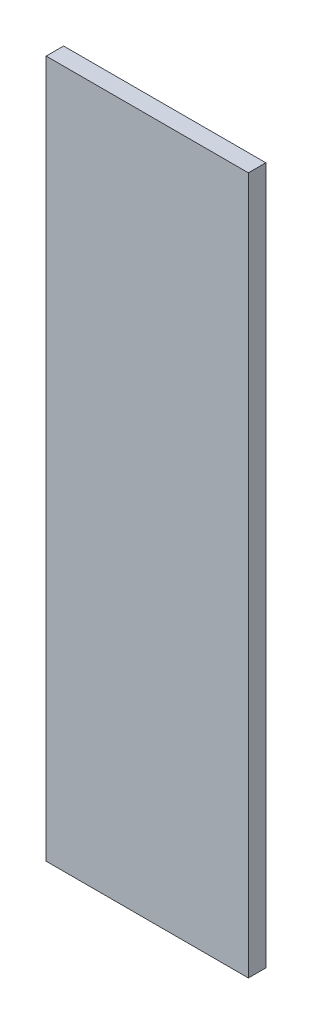
ISO-10303-21;
HEADER;
FILE_DESCRIPTION(('STEP AP214'),'2;1');
FILE_NAME('part.step','',(''),(''),'','','');
FILE_SCHEMA(('AUTOMOTIVE_DESIGN { 1 0 10303 214 1 1 1 1 }'));
ENDSEC;
DATA;
#1=APPLICATION_CONTEXT('core data for automotive mechanical design processes');
#2=APPLICATION_PROTOCOL_DEFINITION('international standard','automotive_design',2000,#1);
#3=PRODUCT_CONTEXT('',#1,'mechanical');
#4=PRODUCT('Part','Part','',(#3));
#5=PRODUCT_RELATED_PRODUCT_CATEGORY('part','',(#4));
#6=PRODUCT_DEFINITION_FORMATION('','',#4);
#7=PRODUCT_DEFINITION_CONTEXT('part definition',#1,'design');
#8=PRODUCT_DEFINITION('design','',#6,#7);
#9=PRODUCT_DEFINITION_SHAPE('','',#8);
#10=(LENGTH_UNIT() NAMED_UNIT(*) SI_UNIT(.MILLI.,.METRE.));
#11=(NAMED_UNIT(*) PLANE_ANGLE_UNIT() SI_UNIT($,.RADIAN.));
#12=(NAMED_UNIT(*) SI_UNIT($,.STERADIAN.) SOLID_ANGLE_UNIT());
#13=UNCERTAINTY_MEASURE_WITH_UNIT(LENGTH_MEASURE(1.E-05),#10,'distance_accuracy_value','');
#14=(GEOMETRIC_REPRESENTATION_CONTEXT(3) GLOBAL_UNCERTAINTY_ASSIGNED_CONTEXT((#13)) GLOBAL_UNIT_ASSIGNED_CONTEXT((#10,
#11,#12)) REPRESENTATION_CONTEXT('',''));
#15=CARTESIAN_POINT('',(0.,0.,0.));
#16=DIRECTION('',(0.,0.,1.));
#17=DIRECTION('',(1.,0.,0.));
#18=AXIS2_PLACEMENT_3D('',#15,#16,#17);
#19=CARTESIAN_POINT('',(-29.,-100.,-5.));
#20=DIRECTION('',(-1.,0.,0.));
#21=DIRECTION('',(0.,0.,1.));
#22=AXIS2_PLACEMENT_3D('',#19,#20,#21);
#23=PLANE('',#22);
#24=DIRECTION('',(0.,-1.,0.));
#25=VECTOR('',#24,1.);
#26=CARTESIAN_POINT('',(-29.,-100.,0.));
#27=LINE('',#26,#25);
#28=CARTESIAN_POINT('',(-29.,100.,0.));
#29=VERTEX_POINT('',#28);
#30=CARTESIAN_POINT('',(-29.,-100.,0.));
#31=VERTEX_POINT('',#30);
#32=EDGE_CURVE('E101',#29,#31,#27,.T.);
#33=ORIENTED_EDGE('',*,*,#32,.F.);
#34=DIRECTION('',(0.,0.,1.));
#35=VECTOR('',#34,1.);
#36=CARTESIAN_POINT('',(-29.,100.,-5.));
#37=LINE('',#36,#35);
#38=CARTESIAN_POINT('',(-29.,100.,-5.));
#39=VERTEX_POINT('',#38);
#40=EDGE_CURVE('E11',#39,#29,#37,.T.);
#41=ORIENTED_EDGE('',*,*,#40,.F.);
#42=DIRECTION('',(0.,-1.,0.));
#43=VECTOR('',#42,1.);
#44=CARTESIAN_POINT('',(-29.,-100.,-5.));
#45=LINE('',#44,#43);
#46=CARTESIAN_POINT('',(-29.,-100.,-5.));
#47=VERTEX_POINT('',#46);
#48=EDGE_CURVE('E95',#39,#47,#45,.T.);
#49=ORIENTED_EDGE('',*,*,#48,.T.);
#50=DIRECTION('',(0.,0.,1.));
#51=VECTOR('',#50,1.);
#52=CARTESIAN_POINT('',(-29.,-100.,-5.));
#53=LINE('',#52,#51);
#54=EDGE_CURVE('E40',#47,#31,#53,.T.);
#55=ORIENTED_EDGE('',*,*,#54,.T.);
#56=EDGE_LOOP('',(#33,#41,#49,#55));
#57=FACE_BOUND('',#56,.T.);
#58=ADVANCED_FACE('F37',(#57),#23,.T.);
#59=CARTESIAN_POINT('',(29.,100.,-5.));
#60=DIRECTION('',(0.,1.,0.));
#61=DIRECTION('',(-1.,0.,0.));
#62=AXIS2_PLACEMENT_3D('',#59,#60,#61);
#63=PLANE('',#62);
#64=DIRECTION('',(-1.,0.,0.));
#65=VECTOR('',#64,1.);
#66=CARTESIAN_POINT('',(29.,100.,0.));
#67=LINE('',#66,#65);
#68=CARTESIAN_POINT('',(29.,100.,0.));
#69=VERTEX_POINT('',#68);
#70=EDGE_CURVE('E97',#69,#29,#67,.T.);
#71=ORIENTED_EDGE('',*,*,#70,.F.);
#72=DIRECTION('',(0.,0.,1.));
#73=VECTOR('',#72,1.);
#74=CARTESIAN_POINT('',(29.,100.,-5.));
#75=LINE('',#74,#73);
#76=CARTESIAN_POINT('',(29.,100.,-5.));
#77=VERTEX_POINT('',#76);
#78=EDGE_CURVE('E46',#77,#69,#75,.T.);
#79=ORIENTED_EDGE('',*,*,#78,.F.);
#80=DIRECTION('',(-1.,0.,0.));
#81=VECTOR('',#80,1.);
#82=CARTESIAN_POINT('',(29.,100.,-5.));
#83=LINE('',#82,#81);
#84=EDGE_CURVE('E92',#77,#39,#83,.T.);
#85=ORIENTED_EDGE('',*,*,#84,.T.);
#86=ORIENTED_EDGE('',*,*,#40,.T.);
#87=EDGE_LOOP('',(#71,#79,#85,#86));
#88=FACE_BOUND('',#87,.T.);
#89=ADVANCED_FACE('F111',(#88),#63,.T.);
#90=CARTESIAN_POINT('',(29.,-100.,-5.));
#91=DIRECTION('',(1.,0.,0.));
#92=DIRECTION('',(0.,0.,-1.));
#93=AXIS2_PLACEMENT_3D('',#90,#91,#92);
#94=PLANE('',#93);
#95=DIRECTION('',(0.,1.,0.));
#96=VECTOR('',#95,1.);
#97=CARTESIAN_POINT('',(29.,-100.,0.));
#98=LINE('',#97,#96);
#99=CARTESIAN_POINT('',(29.,-100.,0.));
#100=VERTEX_POINT('',#99);
#101=EDGE_CURVE('E87',#100,#69,#98,.T.);
#102=ORIENTED_EDGE('',*,*,#101,.F.);
#103=DIRECTION('',(0.,0.,1.));
#104=VECTOR('',#103,1.);
#105=CARTESIAN_POINT('',(29.,-100.,-5.));
#106=LINE('',#105,#104);
#107=CARTESIAN_POINT('',(29.,-100.,-5.));
#108=VERTEX_POINT('',#107);
#109=EDGE_CURVE('E82',#108,#100,#106,.T.);
#110=ORIENTED_EDGE('',*,*,#109,.F.);
#111=DIRECTION('',(0.,1.,0.));
#112=VECTOR('',#111,1.);
#113=CARTESIAN_POINT('',(29.,-100.,-5.));
#114=LINE('',#113,#112);
#115=EDGE_CURVE('E85',#108,#77,#114,.T.);
#116=ORIENTED_EDGE('',*,*,#115,.T.);
#117=ORIENTED_EDGE('',*,*,#78,.T.);
#118=EDGE_LOOP('',(#102,#110,#116,#117));
#119=FACE_BOUND('',#118,.T.);
#120=ADVANCED_FACE('F84',(#119),#94,.T.);
#121=CARTESIAN_POINT('',(29.,-100.,-5.));
#122=DIRECTION('',(0.,-1.,0.));
#123=DIRECTION('',(0.,0.,-1.));
#124=AXIS2_PLACEMENT_3D('',#121,#122,#123);
#125=PLANE('',#124);
#126=DIRECTION('',(1.,0.,0.));
#127=VECTOR('',#126,1.);
#128=CARTESIAN_POINT('',(29.,-100.,0.));
#129=LINE('',#128,#127);
#130=EDGE_CURVE('E104',#31,#100,#129,.T.);
#131=ORIENTED_EDGE('',*,*,#130,.F.);
#132=ORIENTED_EDGE('',*,*,#54,.F.);
#133=DIRECTION('',(1.,0.,0.));
#134=VECTOR('',#133,1.);
#135=CARTESIAN_POINT('',(29.,-100.,-5.));
#136=LINE('',#135,#134);
#137=EDGE_CURVE('E91',#47,#108,#136,.T.);
#138=ORIENTED_EDGE('',*,*,#137,.T.);
#139=ORIENTED_EDGE('',*,*,#109,.T.);
#140=EDGE_LOOP('',(#131,#132,#138,#139));
#141=FACE_BOUND('',#140,.T.);
#142=ADVANCED_FACE('F94',(#141),#125,.T.);
#143=CARTESIAN_POINT('',(0.,0.,-5.));
#144=DIRECTION('',(0.,0.,1.));
#145=DIRECTION('',(1.,0.,0.));
#146=AXIS2_PLACEMENT_3D('',#143,#144,#145);
#147=PLANE('',#146);
#148=ORIENTED_EDGE('',*,*,#48,.F.);
#149=ORIENTED_EDGE('',*,*,#84,.F.);
#150=ORIENTED_EDGE('',*,*,#115,.F.);
#151=ORIENTED_EDGE('',*,*,#137,.F.);
#152=EDGE_LOOP('',(#148,#149,#150,#151));
#153=FACE_BOUND('',#152,.T.);
#154=ADVANCED_FACE('F90',(#153),#147,.F.);
#155=CARTESIAN_POINT('',(0.,0.,0.));
#156=DIRECTION('',(0.,0.,1.));
#157=DIRECTION('',(1.,0.,0.));
#158=AXIS2_PLACEMENT_3D('',#155,#156,#157);
#159=PLANE('',#158);
#160=ORIENTED_EDGE('',*,*,#32,.T.);
#161=ORIENTED_EDGE('',*,*,#130,.T.);
#162=ORIENTED_EDGE('',*,*,#101,.T.);
#163=ORIENTED_EDGE('',*,*,#70,.T.);
#164=EDGE_LOOP('',(#160,#161,#162,#163));
#165=FACE_BOUND('',#164,.T.);
#166=ADVANCED_FACE('F110',(#165),#159,.T.);
#167=CLOSED_SHELL('',(#58,#89,#120,#142,#154,#166));
#168=MANIFOLD_SOLID_BREP('B2',#167);
#169=ADVANCED_BREP_SHAPE_REPRESENTATION('',(#18,#168),#14);
#170=SHAPE_DEFINITION_REPRESENTATION(#9,#169);
ENDSEC;
END-ISO-10303-21;
